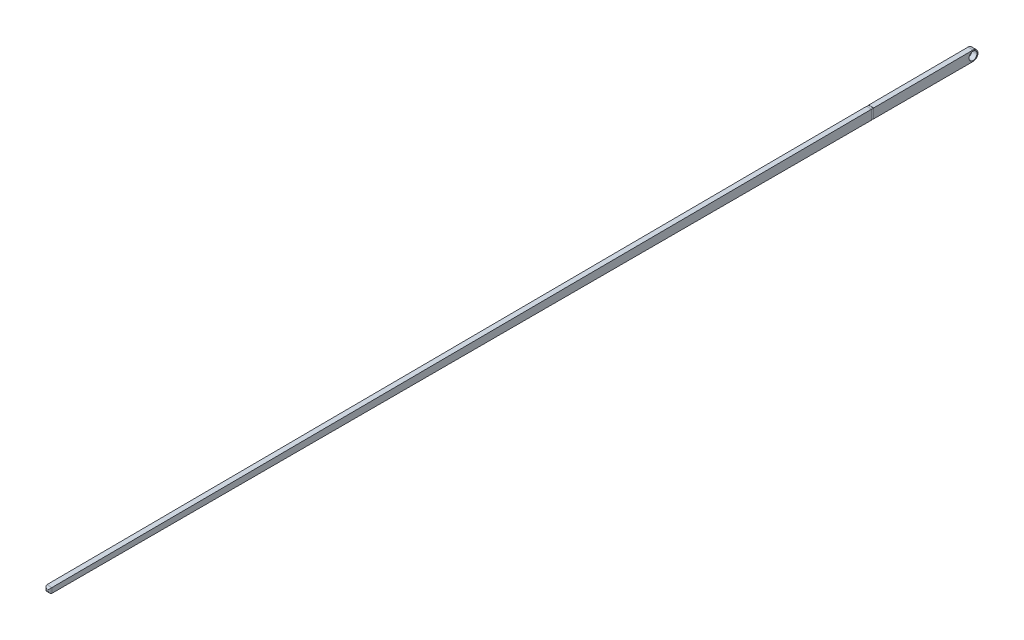
ISO-10303-21;
HEADER;
FILE_DESCRIPTION(('STEP AP214'),'2;1');
FILE_NAME('part.step','',(''),(''),'','','');
FILE_SCHEMA(('AUTOMOTIVE_DESIGN { 1 0 10303 214 1 1 1 1 }'));
ENDSEC;
DATA;
#1=APPLICATION_CONTEXT('core data for automotive mechanical design processes');
#2=APPLICATION_PROTOCOL_DEFINITION('international standard','automotive_design',2000,#1);
#3=PRODUCT_CONTEXT('',#1,'mechanical');
#4=PRODUCT('Part','Part','',(#3));
#5=PRODUCT_RELATED_PRODUCT_CATEGORY('part','',(#4));
#6=PRODUCT_DEFINITION_FORMATION('','',#4);
#7=PRODUCT_DEFINITION_CONTEXT('part definition',#1,'design');
#8=PRODUCT_DEFINITION('design','',#6,#7);
#9=PRODUCT_DEFINITION_SHAPE('','',#8);
#10=(LENGTH_UNIT() NAMED_UNIT(*) SI_UNIT(.MILLI.,.METRE.));
#11=(NAMED_UNIT(*) PLANE_ANGLE_UNIT() SI_UNIT($,.RADIAN.));
#12=(NAMED_UNIT(*) SI_UNIT($,.STERADIAN.) SOLID_ANGLE_UNIT());
#13=UNCERTAINTY_MEASURE_WITH_UNIT(LENGTH_MEASURE(1.E-05),#10,'distance_accuracy_value','');
#14=(GEOMETRIC_REPRESENTATION_CONTEXT(3) GLOBAL_UNCERTAINTY_ASSIGNED_CONTEXT((#13)) GLOBAL_UNIT_ASSIGNED_CONTEXT((#10,
#11,#12)) REPRESENTATION_CONTEXT('',''));
#15=CARTESIAN_POINT('',(0.,0.,0.));
#16=DIRECTION('',(0.,0.,1.));
#17=DIRECTION('',(1.,0.,0.));
#18=AXIS2_PLACEMENT_3D('',#15,#16,#17);
#19=CARTESIAN_POINT('',(0.3175,0.,0.));
#20=DIRECTION('',(-1.,0.,0.));
#21=DIRECTION('',(0.,0.,1.));
#22=AXIS2_PLACEMENT_3D('',#19,#20,#21);
#23=PLANE('',#22);
#24=DIRECTION('',(0.,-1.,0.));
#25=VECTOR('',#24,1.);
#26=CARTESIAN_POINT('',(0.3175,0.,12.827));
#27=LINE('',#26,#25);
#28=CARTESIAN_POINT('',(0.3175,0.56529639208067,12.827));
#29=VERTEX_POINT('',#28);
#30=CARTESIAN_POINT('',(0.3175,-0.635000000000002,12.827));
#31=VERTEX_POINT('',#30);
#32=EDGE_CURVE('E56',#29,#31,#27,.T.);
#33=ORIENTED_EDGE('',*,*,#32,.F.);
#34=DIRECTION('',(0.,-0.00543478260869578,0.999985231459943));
#35=VECTOR('',#34,1.);
#36=CARTESIAN_POINT('',(0.3175,0.634990621977064,0.00345108695652175));
#37=LINE('',#36,#35);
#38=CARTESIAN_POINT('',(0.3175,0.00138045516990203,116.586));
#39=VERTEX_POINT('',#38);
#40=EDGE_CURVE('E213',#29,#39,#37,.T.);
#41=ORIENTED_EDGE('',*,*,#40,.T.);
#42=DIRECTION('',(0.,-1.,0.));
#43=VECTOR('',#42,1.);
#44=CARTESIAN_POINT('',(0.3175,0.,116.586));
#45=LINE('',#44,#43);
#46=CARTESIAN_POINT('',(0.3175,-0.635000000000014,116.586));
#47=VERTEX_POINT('',#46);
#48=EDGE_CURVE('E245',#39,#47,#45,.T.);
#49=ORIENTED_EDGE('',*,*,#48,.T.);
#50=DIRECTION('',(0.,0.,-1.));
#51=VECTOR('',#50,1.);
#52=CARTESIAN_POINT('',(0.3175,-0.635,0.));
#53=LINE('',#52,#51);
#54=EDGE_CURVE('E214',#47,#31,#53,.T.);
#55=ORIENTED_EDGE('',*,*,#54,.T.);
#56=EDGE_LOOP('',(#33,#41,#49,#55));
#57=FACE_BOUND('',#56,.T.);
#58=ADVANCED_FACE('F34',(#57),#23,.F.);
#59=CARTESIAN_POINT('',(-0.3175,0.,0.));
#60=DIRECTION('',(-1.,0.,0.));
#61=DIRECTION('',(0.,0.,1.));
#62=AXIS2_PLACEMENT_3D('',#59,#60,#61);
#63=PLANE('',#62);
#64=DIRECTION('',(0.,-0.00543478260869578,0.999985231459943));
#65=VECTOR('',#64,1.);
#66=CARTESIAN_POINT('',(-0.3175,0.634990621977064,0.00345108695652175));
#67=LINE('',#66,#65);
#68=CARTESIAN_POINT('',(-0.3175,0.56529639208067,12.827));
#69=VERTEX_POINT('',#68);
#70=CARTESIAN_POINT('',(-0.3175,0.00138045516990203,116.586));
#71=VERTEX_POINT('',#70);
#72=EDGE_CURVE('E225',#69,#71,#67,.T.);
#73=ORIENTED_EDGE('',*,*,#72,.F.);
#74=DIRECTION('',(0.,-1.,0.));
#75=VECTOR('',#74,1.);
#76=CARTESIAN_POINT('',(-0.3175,0.,12.827));
#77=LINE('',#76,#75);
#78=CARTESIAN_POINT('',(-0.3175,-0.635000000000002,12.827));
#79=VERTEX_POINT('',#78);
#80=EDGE_CURVE('E179',#69,#79,#77,.T.);
#81=ORIENTED_EDGE('',*,*,#80,.T.);
#82=DIRECTION('',(0.,0.,-1.));
#83=VECTOR('',#82,1.);
#84=CARTESIAN_POINT('',(-0.3175,-0.635,0.));
#85=LINE('',#84,#83);
#86=CARTESIAN_POINT('',(-0.3175,-0.635000000000014,116.586));
#87=VERTEX_POINT('',#86);
#88=EDGE_CURVE('E208',#87,#79,#85,.T.);
#89=ORIENTED_EDGE('',*,*,#88,.F.);
#90=DIRECTION('',(0.,-1.,0.));
#91=VECTOR('',#90,1.);
#92=CARTESIAN_POINT('',(-0.3175,0.,116.586));
#93=LINE('',#92,#91);
#94=EDGE_CURVE('E249',#87,#71,#93,.F.);
#95=ORIENTED_EDGE('',*,*,#94,.T.);
#96=EDGE_LOOP('',(#73,#81,#89,#95));
#97=FACE_BOUND('',#96,.T.);
#98=ADVANCED_FACE('F266',(#97),#63,.T.);
#99=CARTESIAN_POINT('',(0.3175,0.634990621977064,0.00345108695652175));
#100=DIRECTION('',(0.,-0.999985231459943,-0.00543478260869578));
#101=DIRECTION('',(0.,0.00543478260869578,-0.999985231459943));
#102=AXIS2_PLACEMENT_3D('',#99,#100,#101);
#103=PLANE('',#102);
#104=DIRECTION('',(1.,0.,0.));
#105=VECTOR('',#104,1.);
#106=CARTESIAN_POINT('',(0.3175,0.56529639208067,12.827));
#107=LINE('',#106,#105);
#108=EDGE_CURVE('E186',#69,#29,#107,.T.);
#109=ORIENTED_EDGE('',*,*,#108,.F.);
#110=ORIENTED_EDGE('',*,*,#72,.T.);
#111=CARTESIAN_POINT('',(-0.3175,0.00137295269615246,116.587380434783));
#112=VERTEX_POINT('',#111);
#113=EDGE_CURVE('E220',#71,#112,#67,.T.);
#114=ORIENTED_EDGE('',*,*,#113,.T.);
#115=DIRECTION('',(-1.,0.,0.));
#116=VECTOR('',#115,1.);
#117=CARTESIAN_POINT('',(0.3175,0.00137295269615246,116.587380434783));
#118=LINE('',#117,#116);
#119=CARTESIAN_POINT('',(0.3175,0.00137295269615246,116.587380434783));
#120=VERTEX_POINT('',#119);
#121=EDGE_CURVE('E242',#112,#120,#118,.F.);
#122=ORIENTED_EDGE('',*,*,#121,.T.);
#123=EDGE_CURVE('E207',#39,#120,#37,.T.);
#124=ORIENTED_EDGE('',*,*,#123,.F.);
#125=ORIENTED_EDGE('',*,*,#40,.F.);
#126=EDGE_LOOP('',(#109,#110,#114,#122,#124,#125));
#127=FACE_BOUND('',#126,.T.);
#128=ADVANCED_FACE('F290',(#127),#103,.F.);
#129=CARTESIAN_POINT('',(0.3175,-0.635,0.));
#130=DIRECTION('',(0.,1.,0.));
#131=DIRECTION('',(0.,0.,1.));
#132=AXIS2_PLACEMENT_3D('',#129,#130,#131);
#133=PLANE('',#132);
#134=DIRECTION('',(-1.,0.,0.));
#135=VECTOR('',#134,1.);
#136=CARTESIAN_POINT('',(0.3175,-0.635000000000002,12.827));
#137=LINE('',#136,#135);
#138=EDGE_CURVE('E42',#31,#79,#137,.T.);
#139=ORIENTED_EDGE('',*,*,#138,.F.);
#140=ORIENTED_EDGE('',*,*,#54,.F.);
#141=DIRECTION('',(-1.,0.,0.));
#142=VECTOR('',#141,1.);
#143=CARTESIAN_POINT('',(0.3175,-0.635000000000014,116.586));
#144=LINE('',#143,#142);
#145=EDGE_CURVE('E247',#47,#87,#144,.T.);
#146=ORIENTED_EDGE('',*,*,#145,.T.);
#147=ORIENTED_EDGE('',*,*,#88,.T.);
#148=EDGE_LOOP('',(#139,#140,#146,#147));
#149=FACE_BOUND('',#148,.T.);
#150=ADVANCED_FACE('F268',(#149),#133,.F.);
#151=CARTESIAN_POINT('',(0.3175,0.,116.84));
#152=DIRECTION('',(0.,0.,-1.));
#153=DIRECTION('',(-1.,0.,0.));
#154=AXIS2_PLACEMENT_3D('',#151,#152,#153);
#155=PLANE('',#154);
#156=DIRECTION('',(0.,-1.,0.));
#157=VECTOR('',#156,1.);
#158=CARTESIAN_POINT('',(0.0635,0.,116.84));
#159=LINE('',#158,#157);
#160=CARTESIAN_POINT('',(0.0635,-0.381000000000014,116.84));
#161=VERTEX_POINT('',#160);
#162=CARTESIAN_POINT('',(0.0635,-0.252623296094673,116.84));
#163=VERTEX_POINT('',#162);
#164=EDGE_CURVE('E237',#161,#163,#159,.F.);
#165=ORIENTED_EDGE('',*,*,#164,.T.);
#166=DIRECTION('',(-1.,0.,0.));
#167=VECTOR('',#166,1.);
#168=CARTESIAN_POINT('',(0.3175,-0.252623296094673,116.84));
#169=LINE('',#168,#167);
#170=CARTESIAN_POINT('',(-0.0635,-0.252623296094673,116.84));
#171=VERTEX_POINT('',#170);
#172=EDGE_CURVE('E239',#163,#171,#169,.T.);
#173=ORIENTED_EDGE('',*,*,#172,.T.);
#174=DIRECTION('',(0.,-1.,0.));
#175=VECTOR('',#174,1.);
#176=CARTESIAN_POINT('',(-0.0635,-0.635000000000014,116.84));
#177=LINE('',#176,#175);
#178=CARTESIAN_POINT('',(-0.0635,-0.381000000000014,116.84));
#179=VERTEX_POINT('',#178);
#180=EDGE_CURVE('E233',#171,#179,#177,.T.);
#181=ORIENTED_EDGE('',*,*,#180,.T.);
#182=DIRECTION('',(-1.,0.,0.));
#183=VECTOR('',#182,1.);
#184=CARTESIAN_POINT('',(0.3175,-0.381000000000014,116.84));
#185=LINE('',#184,#183);
#186=EDGE_CURVE('E235',#179,#161,#185,.F.);
#187=ORIENTED_EDGE('',*,*,#186,.T.);
#188=EDGE_LOOP('',(#165,#173,#181,#187));
#189=FACE_BOUND('',#188,.T.);
#190=ADVANCED_FACE('F282',(#189),#155,.F.);
#191=CARTESIAN_POINT('',(0.3175,-0.381000000000014,116.586));
#192=DIRECTION('',(-1.,0.,0.));
#193=DIRECTION('',(0.,0.,1.));
#194=AXIS2_PLACEMENT_3D('',#191,#192,#193);
#195=CYLINDRICAL_SURFACE('',#194,0.254);
#196=CARTESIAN_POINT('',(-0.0635,-0.381000000000014,116.586));
#197=DIRECTION('',(-0.707106781186547,0.707106781186547,0.));
#198=DIRECTION('',(0.707106781186547,0.707106781186547,0.));
#199=AXIS2_PLACEMENT_3D('',#196,#197,#198);
#200=ELLIPSE('',#199,0.359210244842766,0.254);
#201=EDGE_CURVE('E255',#87,#179,#200,.T.);
#202=ORIENTED_EDGE('',*,*,#201,.F.);
#203=ORIENTED_EDGE('',*,*,#145,.F.);
#204=CARTESIAN_POINT('',(0.0635,-0.381000000000014,116.586));
#205=DIRECTION('',(-0.707106781186547,-0.707106781186547,0.));
#206=DIRECTION('',(-0.707106781186547,0.707106781186547,0.));
#207=AXIS2_PLACEMENT_3D('',#204,#205,#206);
#208=ELLIPSE('',#207,0.359210244842766,0.254);
#209=EDGE_CURVE('E203',#161,#47,#208,.F.);
#210=ORIENTED_EDGE('',*,*,#209,.F.);
#211=ORIENTED_EDGE('',*,*,#186,.F.);
#212=EDGE_LOOP('',(#202,#203,#210,#211));
#213=FACE_BOUND('',#212,.T.);
#214=ADVANCED_FACE('F36',(#213),#195,.T.);
#215=CARTESIAN_POINT('',(0.0635,0.,116.586));
#216=DIRECTION('',(0.,-1.,0.));
#217=DIRECTION('',(0.,0.,-1.));
#218=AXIS2_PLACEMENT_3D('',#215,#216,#217);
#219=CYLINDRICAL_SURFACE('',#218,0.254);
#220=ORIENTED_EDGE('',*,*,#48,.F.);
#221=ORIENTED_EDGE('',*,*,#123,.T.);
#222=CARTESIAN_POINT('',(0.0635,-0.252623296094673,116.586));
#223=DIRECTION('',(0.707106781186547,-0.707106781186547,0.));
#224=DIRECTION('',(-0.707106781186547,-0.707106781186547,0.));
#225=AXIS2_PLACEMENT_3D('',#222,#223,#224);
#226=ELLIPSE('',#225,0.359210244842766,0.254);
#227=EDGE_CURVE('E253',#163,#120,#226,.F.);
#228=ORIENTED_EDGE('',*,*,#227,.F.);
#229=ORIENTED_EDGE('',*,*,#164,.F.);
#230=ORIENTED_EDGE('',*,*,#209,.T.);
#231=EDGE_LOOP('',(#220,#221,#228,#229,#230));
#232=FACE_BOUND('',#231,.T.);
#233=ADVANCED_FACE('F277',(#232),#219,.T.);
#234=CARTESIAN_POINT('',(-0.0635,0.,116.586));
#235=DIRECTION('',(0.,1.,0.));
#236=DIRECTION('',(0.,0.,1.));
#237=AXIS2_PLACEMENT_3D('',#234,#235,#236);
#238=CYLINDRICAL_SURFACE('',#237,0.254);
#239=ORIENTED_EDGE('',*,*,#201,.T.);
#240=ORIENTED_EDGE('',*,*,#180,.F.);
#241=CARTESIAN_POINT('',(-0.0635,-0.252623296094673,116.586));
#242=DIRECTION('',(0.707106781186547,0.707106781186547,0.));
#243=DIRECTION('',(-0.707106781186547,0.707106781186547,0.));
#244=AXIS2_PLACEMENT_3D('',#241,#242,#243);
#245=ELLIPSE('',#244,0.359210244842766,0.254);
#246=EDGE_CURVE('E195',#112,#171,#245,.T.);
#247=ORIENTED_EDGE('',*,*,#246,.F.);
#248=ORIENTED_EDGE('',*,*,#113,.F.);
#249=ORIENTED_EDGE('',*,*,#94,.F.);
#250=EDGE_LOOP('',(#239,#240,#247,#248,#249));
#251=FACE_BOUND('',#250,.T.);
#252=ADVANCED_FACE('F285',(#251),#238,.T.);
#253=CARTESIAN_POINT('',(0.3175,-0.252623296094673,116.586));
#254=DIRECTION('',(-1.,0.,0.));
#255=DIRECTION('',(0.,0.,1.));
#256=AXIS2_PLACEMENT_3D('',#253,#254,#255);
#257=CYLINDRICAL_SURFACE('',#256,0.254);
#258=ORIENTED_EDGE('',*,*,#227,.T.);
#259=ORIENTED_EDGE('',*,*,#121,.F.);
#260=ORIENTED_EDGE('',*,*,#246,.T.);
#261=ORIENTED_EDGE('',*,*,#172,.F.);
#262=EDGE_LOOP('',(#258,#259,#260,#261));
#263=FACE_BOUND('',#262,.T.);
#264=ADVANCED_FACE('F295',(#263),#257,.T.);
#265=CARTESIAN_POINT('',(0.,0.,12.573));
#266=DIRECTION('',(0.,0.,-1.));
#267=DIRECTION('',(-1.,0.,0.));
#268=AXIS2_PLACEMENT_3D('',#265,#266,#267);
#269=PLANE('',#268);
#270=DIRECTION('',(0.,1.,0.));
#271=VECTOR('',#270,1.);
#272=CARTESIAN_POINT('',(0.3048,-0.609600000000002,12.573));
#273=LINE('',#272,#271);
#274=CARTESIAN_POINT('',(0.3048,-0.609600000000002,12.573));
#275=VERTEX_POINT('',#274);
#276=CARTESIAN_POINT('',(0.3048,0.540586619665628,12.573));
#277=VERTEX_POINT('',#276);
#278=EDGE_CURVE('E157',#275,#277,#273,.T.);
#279=ORIENTED_EDGE('',*,*,#278,.F.);
#280=DIRECTION('',(1.,0.,0.));
#281=VECTOR('',#280,1.);
#282=CARTESIAN_POINT('',(-0.3048,-0.609600000000002,12.573));
#283=LINE('',#282,#281);
#284=CARTESIAN_POINT('',(-0.3048,-0.609600000000002,12.573));
#285=VERTEX_POINT('',#284);
#286=EDGE_CURVE('E151',#285,#275,#283,.T.);
#287=ORIENTED_EDGE('',*,*,#286,.F.);
#288=DIRECTION('',(0.,-1.,0.));
#289=VECTOR('',#288,1.);
#290=CARTESIAN_POINT('',(-0.3048,-0.609600000000002,12.573));
#291=LINE('',#290,#289);
#292=CARTESIAN_POINT('',(-0.3048,0.540586619665628,12.573));
#293=VERTEX_POINT('',#292);
#294=EDGE_CURVE('E160',#293,#285,#291,.T.);
#295=ORIENTED_EDGE('',*,*,#294,.F.);
#296=DIRECTION('',(-1.,0.,0.));
#297=VECTOR('',#296,1.);
#298=CARTESIAN_POINT('',(-0.3048,0.540586619665628,12.573));
#299=LINE('',#298,#297);
#300=EDGE_CURVE('E144',#277,#293,#299,.T.);
#301=ORIENTED_EDGE('',*,*,#300,.F.);
#302=EDGE_LOOP('',(#279,#287,#295,#301));
#303=FACE_BOUND('',#302,.T.);
#304=DIRECTION('',(0.,-1.,0.));
#305=VECTOR('',#304,1.);
#306=CARTESIAN_POINT('',(-0.3175,0.,12.573));
#307=LINE('',#306,#305);
#308=CARTESIAN_POINT('',(-0.3175,0.566676847250586,12.573));
#309=VERTEX_POINT('',#308);
#310=CARTESIAN_POINT('',(-0.3175,-0.635000000000002,12.573));
#311=VERTEX_POINT('',#310);
#312=EDGE_CURVE('E49',#309,#311,#307,.T.);
#313=ORIENTED_EDGE('',*,*,#312,.T.);
#314=DIRECTION('',(-1.,0.,0.));
#315=VECTOR('',#314,1.);
#316=CARTESIAN_POINT('',(0.3175,-0.635000000000002,12.573));
#317=LINE('',#316,#315);
#318=CARTESIAN_POINT('',(0.3175,-0.635000000000002,12.573));
#319=VERTEX_POINT('',#318);
#320=EDGE_CURVE('E11',#319,#311,#317,.T.);
#321=ORIENTED_EDGE('',*,*,#320,.F.);
#322=DIRECTION('',(0.,-1.,0.));
#323=VECTOR('',#322,1.);
#324=CARTESIAN_POINT('',(0.3175,0.,12.573));
#325=LINE('',#324,#323);
#326=CARTESIAN_POINT('',(0.3175,0.566676847250586,12.573));
#327=VERTEX_POINT('',#326);
#328=EDGE_CURVE('E189',#327,#319,#325,.T.);
#329=ORIENTED_EDGE('',*,*,#328,.F.);
#330=DIRECTION('',(1.,0.,0.));
#331=VECTOR('',#330,1.);
#332=CARTESIAN_POINT('',(0.3175,0.566676847250586,12.573));
#333=LINE('',#332,#331);
#334=EDGE_CURVE('E192',#309,#327,#333,.T.);
#335=ORIENTED_EDGE('',*,*,#334,.F.);
#336=EDGE_LOOP('',(#313,#321,#329,#335));
#337=FACE_BOUND('',#336,.T.);
#338=ADVANCED_FACE('F155',(#303,#337),#269,.F.);
#339=CARTESIAN_POINT('',(0.,0.,12.827));
#340=DIRECTION('',(0.,0.,-1.));
#341=DIRECTION('',(-1.,0.,0.));
#342=AXIS2_PLACEMENT_3D('',#339,#340,#341);
#343=PLANE('',#342);
#344=DIRECTION('',(-1.,0.,0.));
#345=VECTOR('',#344,1.);
#346=CARTESIAN_POINT('',(-0.3048,0.540586619665628,12.827));
#347=LINE('',#346,#345);
#348=CARTESIAN_POINT('',(0.3048,0.540586619665628,12.827));
#349=VERTEX_POINT('',#348);
#350=CARTESIAN_POINT('',(-0.3048,0.540586619665628,12.827));
#351=VERTEX_POINT('',#350);
#352=EDGE_CURVE('E146',#349,#351,#347,.T.);
#353=ORIENTED_EDGE('',*,*,#352,.T.);
#354=DIRECTION('',(0.,-1.,0.));
#355=VECTOR('',#354,1.);
#356=CARTESIAN_POINT('',(-0.3048,-0.609600000000002,12.827));
#357=LINE('',#356,#355);
#358=CARTESIAN_POINT('',(-0.3048,-0.609600000000002,12.827));
#359=VERTEX_POINT('',#358);
#360=EDGE_CURVE('E168',#351,#359,#357,.T.);
#361=ORIENTED_EDGE('',*,*,#360,.T.);
#362=DIRECTION('',(1.,0.,0.));
#363=VECTOR('',#362,1.);
#364=CARTESIAN_POINT('',(-0.3048,-0.609600000000002,12.827));
#365=LINE('',#364,#363);
#366=CARTESIAN_POINT('',(0.3048,-0.609600000000002,12.827));
#367=VERTEX_POINT('',#366);
#368=EDGE_CURVE('E165',#359,#367,#365,.T.);
#369=ORIENTED_EDGE('',*,*,#368,.T.);
#370=DIRECTION('',(0.,1.,0.));
#371=VECTOR('',#370,1.);
#372=CARTESIAN_POINT('',(0.3048,-0.609600000000002,12.827));
#373=LINE('',#372,#371);
#374=EDGE_CURVE('E173',#367,#349,#373,.T.);
#375=ORIENTED_EDGE('',*,*,#374,.T.);
#376=EDGE_LOOP('',(#353,#361,#369,#375));
#377=FACE_BOUND('',#376,.T.);
#378=ORIENTED_EDGE('',*,*,#108,.T.);
#379=ORIENTED_EDGE('',*,*,#32,.T.);
#380=ORIENTED_EDGE('',*,*,#138,.T.);
#381=ORIENTED_EDGE('',*,*,#80,.F.);
#382=EDGE_LOOP('',(#378,#379,#380,#381));
#383=FACE_BOUND('',#382,.T.);
#384=ADVANCED_FACE('F259',(#377,#383),#343,.T.);
#385=CARTESIAN_POINT('',(0.3048,-0.609600000000002,12.573));
#386=DIRECTION('',(1.,0.,0.));
#387=DIRECTION('',(0.,1.,0.));
#388=AXIS2_PLACEMENT_3D('',#385,#386,#387);
#389=PLANE('',#388);
#390=ORIENTED_EDGE('',*,*,#374,.F.);
#391=DIRECTION('',(0.,0.,1.));
#392=VECTOR('',#391,1.);
#393=CARTESIAN_POINT('',(0.3048,-0.609600000000002,12.573));
#394=LINE('',#393,#392);
#395=EDGE_CURVE('E164',#275,#367,#394,.T.);
#396=ORIENTED_EDGE('',*,*,#395,.F.);
#397=ORIENTED_EDGE('',*,*,#278,.T.);
#398=DIRECTION('',(0.,0.,1.));
#399=VECTOR('',#398,1.);
#400=CARTESIAN_POINT('',(0.3048,0.540586619665628,12.573));
#401=LINE('',#400,#399);
#402=EDGE_CURVE('E141',#277,#349,#401,.T.);
#403=ORIENTED_EDGE('',*,*,#402,.T.);
#404=EDGE_LOOP('',(#390,#396,#397,#403));
#405=FACE_BOUND('',#404,.T.);
#406=ADVANCED_FACE('F163',(#405),#389,.T.);
#407=CARTESIAN_POINT('',(-0.3048,-0.609600000000002,12.573));
#408=DIRECTION('',(0.,-1.,0.));
#409=DIRECTION('',(0.,0.,-1.));
#410=AXIS2_PLACEMENT_3D('',#407,#408,#409);
#411=PLANE('',#410);
#412=ORIENTED_EDGE('',*,*,#368,.F.);
#413=DIRECTION('',(0.,0.,1.));
#414=VECTOR('',#413,1.);
#415=CARTESIAN_POINT('',(-0.3048,-0.609600000000002,12.573));
#416=LINE('',#415,#414);
#417=EDGE_CURVE('E180',#285,#359,#416,.T.);
#418=ORIENTED_EDGE('',*,*,#417,.F.);
#419=ORIENTED_EDGE('',*,*,#286,.T.);
#420=ORIENTED_EDGE('',*,*,#395,.T.);
#421=EDGE_LOOP('',(#412,#418,#419,#420));
#422=FACE_BOUND('',#421,.T.);
#423=ADVANCED_FACE('F343',(#422),#411,.T.);
#424=CARTESIAN_POINT('',(-0.3048,-0.609600000000002,12.573));
#425=DIRECTION('',(-1.,0.,0.));
#426=DIRECTION('',(0.,-1.,0.));
#427=AXIS2_PLACEMENT_3D('',#424,#425,#426);
#428=PLANE('',#427);
#429=ORIENTED_EDGE('',*,*,#360,.F.);
#430=DIRECTION('',(0.,0.,1.));
#431=VECTOR('',#430,1.);
#432=CARTESIAN_POINT('',(-0.3048,0.540586619665628,12.573));
#433=LINE('',#432,#431);
#434=EDGE_CURVE('E150',#293,#351,#433,.T.);
#435=ORIENTED_EDGE('',*,*,#434,.F.);
#436=ORIENTED_EDGE('',*,*,#294,.T.);
#437=ORIENTED_EDGE('',*,*,#417,.T.);
#438=EDGE_LOOP('',(#429,#435,#436,#437));
#439=FACE_BOUND('',#438,.T.);
#440=ADVANCED_FACE('F336',(#439),#428,.T.);
#441=CARTESIAN_POINT('',(-0.3048,0.540586619665628,12.573));
#442=DIRECTION('',(0.,1.,0.));
#443=DIRECTION('',(0.,0.,1.));
#444=AXIS2_PLACEMENT_3D('',#441,#442,#443);
#445=PLANE('',#444);
#446=ORIENTED_EDGE('',*,*,#352,.F.);
#447=ORIENTED_EDGE('',*,*,#402,.F.);
#448=ORIENTED_EDGE('',*,*,#300,.T.);
#449=ORIENTED_EDGE('',*,*,#434,.T.);
#450=EDGE_LOOP('',(#446,#447,#448,#449));
#451=FACE_BOUND('',#450,.T.);
#452=ADVANCED_FACE('F143',(#451),#445,.T.);
#453=CARTESIAN_POINT('',(0.3175,0.,0.));
#454=DIRECTION('',(-1.,0.,0.));
#455=DIRECTION('',(0.,0.,1.));
#456=AXIS2_PLACEMENT_3D('',#453,#454,#455);
#457=CYLINDRICAL_SURFACE('',#456,0.508);
#458=CARTESIAN_POINT('',(0.3175,0.,0.));
#459=DIRECTION('',(1.,0.,0.));
#460=DIRECTION('',(0.,0.,-1.));
#461=AXIS2_PLACEMENT_3D('',#458,#459,#460);
#462=CIRCLE('',#461,0.508);
#463=CARTESIAN_POINT('',(0.3175,0.,-0.508));
#464=VERTEX_POINT('',#463);
#465=EDGE_CURVE('E196',#464,#464,#462,.T.);
#466=ORIENTED_EDGE('',*,*,#465,.T.);
#467=EDGE_LOOP('',(#466));
#468=FACE_BOUND('',#467,.T.);
#469=CARTESIAN_POINT('',(-0.3175,0.,0.));
#470=DIRECTION('',(1.,0.,0.));
#471=DIRECTION('',(0.,0.,-1.));
#472=AXIS2_PLACEMENT_3D('',#469,#470,#471);
#473=CIRCLE('',#472,0.508);
#474=CARTESIAN_POINT('',(-0.3175,0.,-0.508));
#475=VERTEX_POINT('',#474);
#476=EDGE_CURVE('E200',#475,#475,#473,.T.);
#477=ORIENTED_EDGE('',*,*,#476,.F.);
#478=EDGE_LOOP('',(#477));
#479=FACE_BOUND('',#478,.T.);
#480=ADVANCED_FACE('F324',(#468,#479),#457,.F.);
#481=CARTESIAN_POINT('',(0.3175,0.,0.));
#482=DIRECTION('',(-1.,0.,0.));
#483=DIRECTION('',(0.,0.,1.));
#484=AXIS2_PLACEMENT_3D('',#481,#482,#483);
#485=CYLINDRICAL_SURFACE('',#484,0.635);
#486=CARTESIAN_POINT('',(-0.3175,0.,0.));
#487=DIRECTION('',(1.,0.,0.));
#488=DIRECTION('',(0.,0.,1.));
#489=AXIS2_PLACEMENT_3D('',#486,#487,#488);
#490=CIRCLE('',#489,0.635);
#491=CARTESIAN_POINT('',(-0.3175,-0.635,0.));
#492=VERTEX_POINT('',#491);
#493=CARTESIAN_POINT('',(-0.3175,0.634990621977064,0.00345108695652175));
#494=VERTEX_POINT('',#493);
#495=EDGE_CURVE('E199',#492,#494,#490,.T.);
#496=ORIENTED_EDGE('',*,*,#495,.T.);
#497=DIRECTION('',(-1.,0.,0.));
#498=VECTOR('',#497,1.);
#499=CARTESIAN_POINT('',(0.3175,0.634990621977064,0.00345108695652175));
#500=LINE('',#499,#498);
#501=CARTESIAN_POINT('',(0.3175,0.634990621977064,0.00345108695652175));
#502=VERTEX_POINT('',#501);
#503=EDGE_CURVE('E230',#502,#494,#500,.T.);
#504=ORIENTED_EDGE('',*,*,#503,.F.);
#505=CARTESIAN_POINT('',(0.3175,0.,0.));
#506=DIRECTION('',(1.,0.,0.));
#507=DIRECTION('',(0.,0.,1.));
#508=AXIS2_PLACEMENT_3D('',#505,#506,#507);
#509=CIRCLE('',#508,0.635);
#510=CARTESIAN_POINT('',(0.3175,-0.635,0.));
#511=VERTEX_POINT('',#510);
#512=EDGE_CURVE('E204',#511,#502,#509,.T.);
#513=ORIENTED_EDGE('',*,*,#512,.F.);
#514=DIRECTION('',(-1.,0.,0.));
#515=VECTOR('',#514,1.);
#516=CARTESIAN_POINT('',(0.3175,-0.635,0.));
#517=LINE('',#516,#515);
#518=EDGE_CURVE('E217',#511,#492,#517,.T.);
#519=ORIENTED_EDGE('',*,*,#518,.T.);
#520=EDGE_LOOP('',(#496,#504,#513,#519));
#521=FACE_BOUND('',#520,.T.);
#522=ADVANCED_FACE('F327',(#521),#485,.T.);
#523=EDGE_CURVE('E212',#319,#511,#53,.T.);
#524=ORIENTED_EDGE('',*,*,#523,.F.);
#525=ORIENTED_EDGE('',*,*,#320,.T.);
#526=EDGE_CURVE('E224',#311,#492,#85,.T.);
#527=ORIENTED_EDGE('',*,*,#526,.T.);
#528=ORIENTED_EDGE('',*,*,#518,.F.);
#529=EDGE_LOOP('',(#524,#525,#527,#528));
#530=FACE_BOUND('',#529,.T.);
#531=ADVANCED_FACE('F334',(#530),#133,.F.);
#532=EDGE_CURVE('E221',#494,#309,#67,.T.);
#533=ORIENTED_EDGE('',*,*,#532,.T.);
#534=ORIENTED_EDGE('',*,*,#334,.T.);
#535=EDGE_CURVE('E209',#502,#327,#37,.T.);
#536=ORIENTED_EDGE('',*,*,#535,.F.);
#537=ORIENTED_EDGE('',*,*,#503,.T.);
#538=EDGE_LOOP('',(#533,#534,#536,#537));
#539=FACE_BOUND('',#538,.T.);
#540=ADVANCED_FACE('F319',(#539),#103,.F.);
#541=ORIENTED_EDGE('',*,*,#312,.F.);
#542=ORIENTED_EDGE('',*,*,#532,.F.);
#543=ORIENTED_EDGE('',*,*,#495,.F.);
#544=ORIENTED_EDGE('',*,*,#526,.F.);
#545=EDGE_LOOP('',(#541,#542,#543,#544));
#546=FACE_BOUND('',#545,.T.);
#547=ORIENTED_EDGE('',*,*,#476,.T.);
#548=EDGE_LOOP('',(#547));
#549=FACE_BOUND('',#548,.T.);
#550=ADVANCED_FACE('F312',(#546,#549),#63,.T.);
#551=ORIENTED_EDGE('',*,*,#535,.T.);
#552=ORIENTED_EDGE('',*,*,#328,.T.);
#553=ORIENTED_EDGE('',*,*,#523,.T.);
#554=ORIENTED_EDGE('',*,*,#512,.T.);
#555=EDGE_LOOP('',(#551,#552,#553,#554));
#556=FACE_BOUND('',#555,.T.);
#557=ORIENTED_EDGE('',*,*,#465,.F.);
#558=EDGE_LOOP('',(#557));
#559=FACE_BOUND('',#558,.T.);
#560=ADVANCED_FACE('F307',(#556,#559),#23,.F.);
#561=CLOSED_SHELL('',(#58,#98,#128,#150,#190,#214,#233,#252,#264,#338,#384,#406,#423,#440,#452,
#480,#522,#531,#540,#550,#560));
#562=MANIFOLD_SOLID_BREP('B2',#561);
#563=ADVANCED_BREP_SHAPE_REPRESENTATION('',(#18,#562),#14);
#564=SHAPE_DEFINITION_REPRESENTATION(#9,#563);
ENDSEC;
END-ISO-10303-21;
